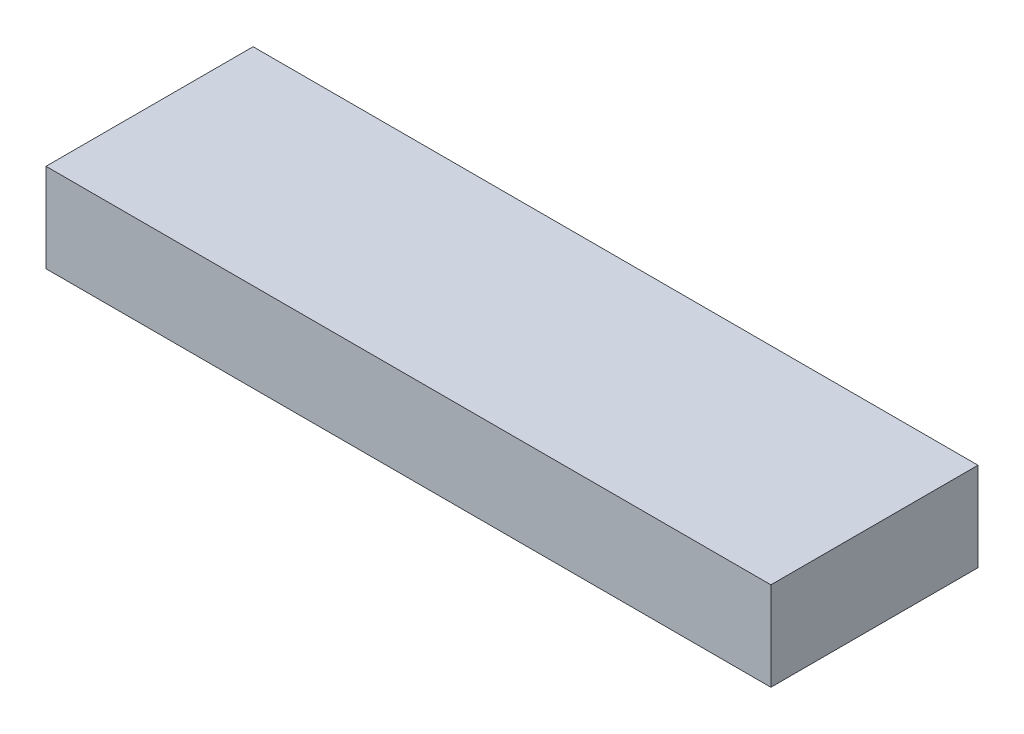
ISO-10303-21;
HEADER;
FILE_DESCRIPTION(('STEP AP214'),'2;1');
FILE_NAME('part.step','',(''),(''),'','','');
FILE_SCHEMA(('AUTOMOTIVE_DESIGN { 1 0 10303 214 1 1 1 1 }'));
ENDSEC;
DATA;
#1=APPLICATION_CONTEXT('core data for automotive mechanical design processes');
#2=APPLICATION_PROTOCOL_DEFINITION('international standard','automotive_design',2000,#1);
#3=PRODUCT_CONTEXT('',#1,'mechanical');
#4=PRODUCT('Part','Part','',(#3));
#5=PRODUCT_RELATED_PRODUCT_CATEGORY('part','',(#4));
#6=PRODUCT_DEFINITION_FORMATION('','',#4);
#7=PRODUCT_DEFINITION_CONTEXT('part definition',#1,'design');
#8=PRODUCT_DEFINITION('design','',#6,#7);
#9=PRODUCT_DEFINITION_SHAPE('','',#8);
#10=(LENGTH_UNIT() NAMED_UNIT(*) SI_UNIT(.MILLI.,.METRE.));
#11=(NAMED_UNIT(*) PLANE_ANGLE_UNIT() SI_UNIT($,.RADIAN.));
#12=(NAMED_UNIT(*) SI_UNIT($,.STERADIAN.) SOLID_ANGLE_UNIT());
#13=UNCERTAINTY_MEASURE_WITH_UNIT(LENGTH_MEASURE(1.E-05),#10,'distance_accuracy_value','');
#14=(GEOMETRIC_REPRESENTATION_CONTEXT(3) GLOBAL_UNCERTAINTY_ASSIGNED_CONTEXT((#13)) GLOBAL_UNIT_ASSIGNED_CONTEXT((#10,
#11,#12)) REPRESENTATION_CONTEXT('',''));
#15=CARTESIAN_POINT('',(0.,0.,0.));
#16=DIRECTION('',(0.,0.,1.));
#17=DIRECTION('',(1.,0.,0.));
#18=AXIS2_PLACEMENT_3D('',#15,#16,#17);
#19=CARTESIAN_POINT('',(0.,38.1,0.));
#20=DIRECTION('',(1.,0.,0.));
#21=DIRECTION('',(0.,0.,-1.));
#22=AXIS2_PLACEMENT_3D('',#19,#20,#21);
#23=PLANE('',#22);
#24=DIRECTION('',(0.,0.,1.));
#25=VECTOR('',#24,1.);
#26=CARTESIAN_POINT('',(0.,0.,0.));
#27=LINE('',#26,#25);
#28=CARTESIAN_POINT('',(0.,0.,0.));
#29=VERTEX_POINT('',#28);
#30=CARTESIAN_POINT('',(0.,0.,88.9));
#31=VERTEX_POINT('',#30);
#32=EDGE_CURVE('E96',#29,#31,#27,.T.);
#33=ORIENTED_EDGE('',*,*,#32,.T.);
#34=DIRECTION('',(0.,-1.,0.));
#35=VECTOR('',#34,1.);
#36=CARTESIAN_POINT('',(0.,38.1,88.9));
#37=LINE('',#36,#35);
#38=CARTESIAN_POINT('',(0.,38.1,88.9));
#39=VERTEX_POINT('',#38);
#40=EDGE_CURVE('E11',#39,#31,#37,.T.);
#41=ORIENTED_EDGE('',*,*,#40,.F.);
#42=DIRECTION('',(0.,0.,1.));
#43=VECTOR('',#42,1.);
#44=CARTESIAN_POINT('',(0.,38.1,0.));
#45=LINE('',#44,#43);
#46=CARTESIAN_POINT('',(0.,38.1,0.));
#47=VERTEX_POINT('',#46);
#48=EDGE_CURVE('E84',#47,#39,#45,.T.);
#49=ORIENTED_EDGE('',*,*,#48,.F.);
#50=DIRECTION('',(0.,-1.,0.));
#51=VECTOR('',#50,1.);
#52=CARTESIAN_POINT('',(0.,38.1,0.));
#53=LINE('',#52,#51);
#54=EDGE_CURVE('E92',#47,#29,#53,.T.);
#55=ORIENTED_EDGE('',*,*,#54,.T.);
#56=EDGE_LOOP('',(#33,#41,#49,#55));
#57=FACE_BOUND('',#56,.T.);
#58=ADVANCED_FACE('F33',(#57),#23,.F.);
#59=CARTESIAN_POINT('',(0.,38.1,88.9));
#60=DIRECTION('',(0.,0.,-1.));
#61=DIRECTION('',(-1.,0.,0.));
#62=AXIS2_PLACEMENT_3D('',#59,#60,#61);
#63=PLANE('',#62);
#64=DIRECTION('',(1.,0.,0.));
#65=VECTOR('',#64,1.);
#66=CARTESIAN_POINT('',(0.,0.,88.9));
#67=LINE('',#66,#65);
#68=CARTESIAN_POINT('',(311.15,0.,88.9));
#69=VERTEX_POINT('',#68);
#70=EDGE_CURVE('E88',#31,#69,#67,.T.);
#71=ORIENTED_EDGE('',*,*,#70,.T.);
#72=DIRECTION('',(0.,-1.,0.));
#73=VECTOR('',#72,1.);
#74=CARTESIAN_POINT('',(311.15,38.1,88.9));
#75=LINE('',#74,#73);
#76=CARTESIAN_POINT('',(311.15,38.1,88.9));
#77=VERTEX_POINT('',#76);
#78=EDGE_CURVE('E41',#77,#69,#75,.T.);
#79=ORIENTED_EDGE('',*,*,#78,.F.);
#80=DIRECTION('',(1.,0.,0.));
#81=VECTOR('',#80,1.);
#82=CARTESIAN_POINT('',(0.,38.1,88.9));
#83=LINE('',#82,#81);
#84=EDGE_CURVE('E79',#39,#77,#83,.T.);
#85=ORIENTED_EDGE('',*,*,#84,.F.);
#86=ORIENTED_EDGE('',*,*,#40,.T.);
#87=EDGE_LOOP('',(#71,#79,#85,#86));
#88=FACE_BOUND('',#87,.T.);
#89=ADVANCED_FACE('F87',(#88),#63,.F.);
#90=CARTESIAN_POINT('',(311.15,38.1,0.));
#91=DIRECTION('',(-1.,0.,0.));
#92=DIRECTION('',(0.,0.,1.));
#93=AXIS2_PLACEMENT_3D('',#90,#91,#92);
#94=PLANE('',#93);
#95=DIRECTION('',(0.,0.,-1.));
#96=VECTOR('',#95,1.);
#97=CARTESIAN_POINT('',(311.15,0.,0.));
#98=LINE('',#97,#96);
#99=CARTESIAN_POINT('',(311.15,0.,0.));
#100=VERTEX_POINT('',#99);
#101=EDGE_CURVE('E66',#69,#100,#98,.T.);
#102=ORIENTED_EDGE('',*,*,#101,.T.);
#103=DIRECTION('',(0.,-1.,0.));
#104=VECTOR('',#103,1.);
#105=CARTESIAN_POINT('',(311.15,38.1,0.));
#106=LINE('',#105,#104);
#107=CARTESIAN_POINT('',(311.15,38.1,0.));
#108=VERTEX_POINT('',#107);
#109=EDGE_CURVE('E89',#108,#100,#106,.T.);
#110=ORIENTED_EDGE('',*,*,#109,.F.);
#111=DIRECTION('',(0.,0.,-1.));
#112=VECTOR('',#111,1.);
#113=CARTESIAN_POINT('',(311.15,38.1,0.));
#114=LINE('',#113,#112);
#115=EDGE_CURVE('E82',#77,#108,#114,.T.);
#116=ORIENTED_EDGE('',*,*,#115,.F.);
#117=ORIENTED_EDGE('',*,*,#78,.T.);
#118=EDGE_LOOP('',(#102,#110,#116,#117));
#119=FACE_BOUND('',#118,.T.);
#120=ADVANCED_FACE('F90',(#119),#94,.F.);
#121=CARTESIAN_POINT('',(0.,38.1,0.));
#122=DIRECTION('',(0.,0.,1.));
#123=DIRECTION('',(1.,0.,0.));
#124=AXIS2_PLACEMENT_3D('',#121,#122,#123);
#125=PLANE('',#124);
#126=DIRECTION('',(-1.,0.,0.));
#127=VECTOR('',#126,1.);
#128=CARTESIAN_POINT('',(0.,0.,0.));
#129=LINE('',#128,#127);
#130=EDGE_CURVE('E72',#100,#29,#129,.T.);
#131=ORIENTED_EDGE('',*,*,#130,.T.);
#132=ORIENTED_EDGE('',*,*,#54,.F.);
#133=DIRECTION('',(-1.,0.,0.));
#134=VECTOR('',#133,1.);
#135=CARTESIAN_POINT('',(0.,38.1,0.));
#136=LINE('',#135,#134);
#137=EDGE_CURVE('E49',#108,#47,#136,.T.);
#138=ORIENTED_EDGE('',*,*,#137,.F.);
#139=ORIENTED_EDGE('',*,*,#109,.T.);
#140=EDGE_LOOP('',(#131,#132,#138,#139));
#141=FACE_BOUND('',#140,.T.);
#142=ADVANCED_FACE('F103',(#141),#125,.F.);
#143=CARTESIAN_POINT('',(0.,38.1,0.));
#144=DIRECTION('',(0.,1.,0.));
#145=DIRECTION('',(0.,0.,1.));
#146=AXIS2_PLACEMENT_3D('',#143,#144,#145);
#147=PLANE('',#146);
#148=ORIENTED_EDGE('',*,*,#48,.T.);
#149=ORIENTED_EDGE('',*,*,#84,.T.);
#150=ORIENTED_EDGE('',*,*,#115,.T.);
#151=ORIENTED_EDGE('',*,*,#137,.T.);
#152=EDGE_LOOP('',(#148,#149,#150,#151));
#153=FACE_BOUND('',#152,.T.);
#154=ADVANCED_FACE('F80',(#153),#147,.T.);
#155=CARTESIAN_POINT('',(0.,0.,0.));
#156=DIRECTION('',(0.,1.,0.));
#157=DIRECTION('',(0.,0.,1.));
#158=AXIS2_PLACEMENT_3D('',#155,#156,#157);
#159=PLANE('',#158);
#160=ORIENTED_EDGE('',*,*,#32,.F.);
#161=ORIENTED_EDGE('',*,*,#130,.F.);
#162=ORIENTED_EDGE('',*,*,#101,.F.);
#163=ORIENTED_EDGE('',*,*,#70,.F.);
#164=EDGE_LOOP('',(#160,#161,#162,#163));
#165=FACE_BOUND('',#164,.T.);
#166=ADVANCED_FACE('F106',(#165),#159,.F.);
#167=CLOSED_SHELL('',(#58,#89,#120,#142,#154,#166));
#168=MANIFOLD_SOLID_BREP('B2',#167);
#169=ADVANCED_BREP_SHAPE_REPRESENTATION('',(#18,#168),#14);
#170=SHAPE_DEFINITION_REPRESENTATION(#9,#169);
ENDSEC;
END-ISO-10303-21;
